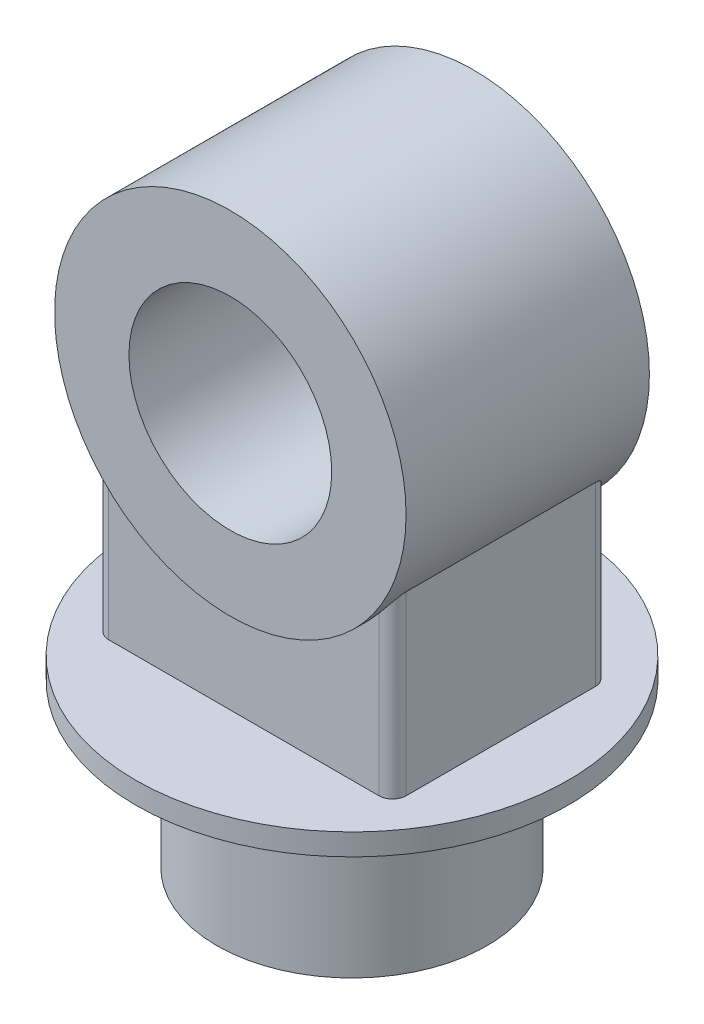
ISO-10303-21;
HEADER;
FILE_DESCRIPTION(('STEP AP214'),'2;1');
FILE_NAME('part.step','',(''),(''),'','','');
FILE_SCHEMA(('AUTOMOTIVE_DESIGN { 1 0 10303 214 1 1 1 1 }'));
ENDSEC;
DATA;
#1=APPLICATION_CONTEXT('core data for automotive mechanical design processes');
#2=APPLICATION_PROTOCOL_DEFINITION('international standard','automotive_design',2000,#1);
#3=PRODUCT_CONTEXT('',#1,'mechanical');
#4=PRODUCT('Part','Part','',(#3));
#5=PRODUCT_RELATED_PRODUCT_CATEGORY('part','',(#4));
#6=PRODUCT_DEFINITION_FORMATION('','',#4);
#7=PRODUCT_DEFINITION_CONTEXT('part definition',#1,'design');
#8=PRODUCT_DEFINITION('design','',#6,#7);
#9=PRODUCT_DEFINITION_SHAPE('','',#8);
#10=(LENGTH_UNIT() NAMED_UNIT(*) SI_UNIT(.MILLI.,.METRE.));
#11=(NAMED_UNIT(*) PLANE_ANGLE_UNIT() SI_UNIT($,.RADIAN.));
#12=(NAMED_UNIT(*) SI_UNIT($,.STERADIAN.) SOLID_ANGLE_UNIT());
#13=UNCERTAINTY_MEASURE_WITH_UNIT(LENGTH_MEASURE(1.E-05),#10,'distance_accuracy_value','');
#14=(GEOMETRIC_REPRESENTATION_CONTEXT(3) GLOBAL_UNCERTAINTY_ASSIGNED_CONTEXT((#13)) GLOBAL_UNIT_ASSIGNED_CONTEXT((#10,
#11,#12)) REPRESENTATION_CONTEXT('',''));
#15=CARTESIAN_POINT('',(0.,0.,0.));
#16=DIRECTION('',(0.,0.,1.));
#17=DIRECTION('',(1.,0.,0.));
#18=AXIS2_PLACEMENT_3D('',#15,#16,#17);
#19=CARTESIAN_POINT('',(0.,120.,0.));
#20=DIRECTION('',(0.,-1.,0.));
#21=DIRECTION('',(0.,0.,-1.));
#22=AXIS2_PLACEMENT_3D('',#19,#20,#21);
#23=CYLINDRICAL_SURFACE('',#22,100.);
#24=CARTESIAN_POINT('',(0.,120.,0.));
#25=DIRECTION('',(0.,1.,0.));
#26=DIRECTION('',(0.,0.,1.));
#27=AXIS2_PLACEMENT_3D('',#24,#25,#26);
#28=CIRCLE('',#27,100.);
#29=CARTESIAN_POINT('',(0.,120.,100.));
#30=VERTEX_POINT('',#29);
#31=EDGE_CURVE('E144',#30,#30,#28,.T.);
#32=ORIENTED_EDGE('',*,*,#31,.F.);
#33=EDGE_LOOP('',(#32));
#34=FACE_BOUND('',#33,.T.);
#35=CARTESIAN_POINT('',(0.,0.,0.));
#36=DIRECTION('',(0.,1.,0.));
#37=DIRECTION('',(0.,0.,1.));
#38=AXIS2_PLACEMENT_3D('',#35,#36,#37);
#39=CIRCLE('',#38,100.);
#40=CARTESIAN_POINT('',(0.,0.,100.));
#41=VERTEX_POINT('',#40);
#42=EDGE_CURVE('E218',#41,#41,#39,.T.);
#43=ORIENTED_EDGE('',*,*,#42,.T.);
#44=EDGE_LOOP('',(#43));
#45=FACE_BOUND('',#44,.T.);
#46=ADVANCED_FACE('F43',(#34,#45),#23,.T.);
#47=CARTESIAN_POINT('',(0.,0.,0.));
#48=DIRECTION('',(0.,1.,0.));
#49=DIRECTION('',(0.,0.,1.));
#50=AXIS2_PLACEMENT_3D('',#47,#48,#49);
#51=PLANE('',#50);
#52=ORIENTED_EDGE('',*,*,#42,.F.);
#53=EDGE_LOOP('',(#52));
#54=FACE_BOUND('',#53,.T.);
#55=ADVANCED_FACE('F206',(#54),#51,.F.);
#56=CARTESIAN_POINT('',(0.,136.,0.));
#57=DIRECTION('',(0.,-1.,0.));
#58=DIRECTION('',(0.,0.,-1.));
#59=AXIS2_PLACEMENT_3D('',#56,#57,#58);
#60=CYLINDRICAL_SURFACE('',#59,160.);
#61=CARTESIAN_POINT('',(0.,136.,0.));
#62=DIRECTION('',(0.,1.,0.));
#63=DIRECTION('',(0.,0.,1.));
#64=AXIS2_PLACEMENT_3D('',#61,#62,#63);
#65=CIRCLE('',#64,160.);
#66=CARTESIAN_POINT('',(0.,136.,160.));
#67=VERTEX_POINT('',#66);
#68=EDGE_CURVE('E219',#67,#67,#65,.T.);
#69=ORIENTED_EDGE('',*,*,#68,.F.);
#70=EDGE_LOOP('',(#69));
#71=FACE_BOUND('',#70,.T.);
#72=CARTESIAN_POINT('',(0.,120.,0.));
#73=DIRECTION('',(0.,1.,0.));
#74=DIRECTION('',(0.,0.,1.));
#75=AXIS2_PLACEMENT_3D('',#72,#73,#74);
#76=CIRCLE('',#75,160.);
#77=CARTESIAN_POINT('',(0.,120.,160.));
#78=VERTEX_POINT('',#77);
#79=EDGE_CURVE('E222',#78,#78,#76,.T.);
#80=ORIENTED_EDGE('',*,*,#79,.T.);
#81=EDGE_LOOP('',(#80));
#82=FACE_BOUND('',#81,.T.);
#83=ADVANCED_FACE('F211',(#71,#82),#60,.T.);
#84=CARTESIAN_POINT('',(0.,136.,0.));
#85=DIRECTION('',(0.,1.,0.));
#86=DIRECTION('',(0.,0.,1.));
#87=AXIS2_PLACEMENT_3D('',#84,#85,#86);
#88=PLANE('',#87);
#89=DIRECTION('',(0.,0.,-1.));
#90=VECTOR('',#89,1.);
#91=CARTESIAN_POINT('',(110.,136.,80.));
#92=LINE('',#91,#90);
#93=CARTESIAN_POINT('',(110.,136.,70.));
#94=VERTEX_POINT('',#93);
#95=CARTESIAN_POINT('',(110.,136.,-70.));
#96=VERTEX_POINT('',#95);
#97=EDGE_CURVE('E226',#94,#96,#92,.T.);
#98=ORIENTED_EDGE('',*,*,#97,.F.);
#99=CARTESIAN_POINT('',(100.,136.,70.));
#100=DIRECTION('',(0.,1.,0.));
#101=DIRECTION('',(0.,0.,1.));
#102=AXIS2_PLACEMENT_3D('',#99,#100,#101);
#103=CIRCLE('',#102,10.);
#104=CARTESIAN_POINT('',(100.,136.,80.));
#105=VERTEX_POINT('',#104);
#106=EDGE_CURVE('E126',#94,#105,#103,.F.);
#107=ORIENTED_EDGE('',*,*,#106,.T.);
#108=DIRECTION('',(1.,0.,0.));
#109=VECTOR('',#108,1.);
#110=CARTESIAN_POINT('',(-110.,136.,80.));
#111=LINE('',#110,#109);
#112=CARTESIAN_POINT('',(-100.,136.,80.));
#113=VERTEX_POINT('',#112);
#114=EDGE_CURVE('E231',#113,#105,#111,.T.);
#115=ORIENTED_EDGE('',*,*,#114,.F.);
#116=CARTESIAN_POINT('',(-100.,136.,70.));
#117=DIRECTION('',(0.,1.,0.));
#118=DIRECTION('',(0.,0.,1.));
#119=AXIS2_PLACEMENT_3D('',#116,#117,#118);
#120=CIRCLE('',#119,10.);
#121=CARTESIAN_POINT('',(-110.,136.,70.));
#122=VERTEX_POINT('',#121);
#123=EDGE_CURVE('E57',#113,#122,#120,.F.);
#124=ORIENTED_EDGE('',*,*,#123,.T.);
#125=DIRECTION('',(0.,0.,1.));
#126=VECTOR('',#125,1.);
#127=CARTESIAN_POINT('',(-110.,136.,80.));
#128=LINE('',#127,#126);
#129=CARTESIAN_POINT('',(-110.,136.,-70.));
#130=VERTEX_POINT('',#129);
#131=EDGE_CURVE('E234',#130,#122,#128,.T.);
#132=ORIENTED_EDGE('',*,*,#131,.F.);
#133=CARTESIAN_POINT('',(-100.,136.,-70.));
#134=DIRECTION('',(0.,1.,0.));
#135=DIRECTION('',(0.,0.,1.));
#136=AXIS2_PLACEMENT_3D('',#133,#134,#135);
#137=CIRCLE('',#136,10.);
#138=CARTESIAN_POINT('',(-100.,136.,-80.));
#139=VERTEX_POINT('',#138);
#140=EDGE_CURVE('E71',#130,#139,#137,.F.);
#141=ORIENTED_EDGE('',*,*,#140,.T.);
#142=DIRECTION('',(-1.,0.,0.));
#143=VECTOR('',#142,1.);
#144=CARTESIAN_POINT('',(-110.,136.,-80.));
#145=LINE('',#144,#143);
#146=CARTESIAN_POINT('',(100.,136.,-80.));
#147=VERTEX_POINT('',#146);
#148=EDGE_CURVE('E237',#147,#139,#145,.T.);
#149=ORIENTED_EDGE('',*,*,#148,.F.);
#150=CARTESIAN_POINT('',(100.,136.,-70.));
#151=DIRECTION('',(0.,1.,0.));
#152=DIRECTION('',(0.,0.,1.));
#153=AXIS2_PLACEMENT_3D('',#150,#151,#152);
#154=CIRCLE('',#153,10.);
#155=EDGE_CURVE('E127',#147,#96,#154,.F.);
#156=ORIENTED_EDGE('',*,*,#155,.T.);
#157=EDGE_LOOP('',(#98,#107,#115,#124,#132,#141,#149,#156));
#158=FACE_BOUND('',#157,.T.);
#159=ORIENTED_EDGE('',*,*,#68,.T.);
#160=EDGE_LOOP('',(#159));
#161=FACE_BOUND('',#160,.T.);
#162=ADVANCED_FACE('F368',(#158,#161),#88,.T.);
#163=CARTESIAN_POINT('',(0.,120.,0.));
#164=DIRECTION('',(0.,1.,0.));
#165=DIRECTION('',(0.,0.,1.));
#166=AXIS2_PLACEMENT_3D('',#163,#164,#165);
#167=PLANE('',#166);
#168=ORIENTED_EDGE('',*,*,#31,.T.);
#169=EDGE_LOOP('',(#168));
#170=FACE_BOUND('',#169,.T.);
#171=ORIENTED_EDGE('',*,*,#79,.F.);
#172=EDGE_LOOP('',(#171));
#173=FACE_BOUND('',#172,.T.);
#174=ADVANCED_FACE('F337',(#170,#173),#167,.F.);
#175=CARTESIAN_POINT('',(-110.,466.002,-80.));
#176=DIRECTION('',(0.,0.,1.));
#177=DIRECTION('',(1.,0.,0.));
#178=AXIS2_PLACEMENT_3D('',#175,#176,#177);
#179=PLANE('',#178);
#180=CARTESIAN_POINT('',(0.,336.,-80.));
#181=DIRECTION('',(0.,0.,1.));
#182=DIRECTION('',(1.,0.,0.));
#183=AXIS2_PLACEMENT_3D('',#180,#181,#182);
#184=CIRCLE('',#183,130.);
#185=CARTESIAN_POINT('',(100.,252.933761370819,-80.));
#186=VERTEX_POINT('',#185);
#187=CARTESIAN_POINT('',(-100.,252.933761370819,-80.));
#188=VERTEX_POINT('',#187);
#189=EDGE_CURVE('E119',#186,#188,#184,.F.);
#190=ORIENTED_EDGE('',*,*,#189,.F.);
#191=DIRECTION('',(0.,-1.,0.));
#192=VECTOR('',#191,1.);
#193=CARTESIAN_POINT('',(100.,466.002,-80.));
#194=LINE('',#193,#192);
#195=EDGE_CURVE('E133',#186,#147,#194,.T.);
#196=ORIENTED_EDGE('',*,*,#195,.T.);
#197=ORIENTED_EDGE('',*,*,#148,.T.);
#198=DIRECTION('',(0.,-1.,0.));
#199=VECTOR('',#198,1.);
#200=CARTESIAN_POINT('',(-100.,466.002,-80.));
#201=LINE('',#200,#199);
#202=EDGE_CURVE('E135',#139,#188,#201,.F.);
#203=ORIENTED_EDGE('',*,*,#202,.T.);
#204=EDGE_LOOP('',(#190,#196,#197,#203));
#205=FACE_BOUND('',#204,.T.);
#206=ADVANCED_FACE('F131',(#205),#179,.F.);
#207=CARTESIAN_POINT('',(110.,466.002,80.));
#208=DIRECTION('',(-1.,0.,0.));
#209=DIRECTION('',(0.,0.,1.));
#210=AXIS2_PLACEMENT_3D('',#207,#208,#209);
#211=PLANE('',#210);
#212=ORIENTED_EDGE('',*,*,#97,.T.);
#213=DIRECTION('',(0.,-1.,0.));
#214=VECTOR('',#213,1.);
#215=CARTESIAN_POINT('',(110.,466.002,-70.));
#216=LINE('',#215,#214);
#217=CARTESIAN_POINT('',(110.,266.717967697245,-70.));
#218=VERTEX_POINT('',#217);
#219=EDGE_CURVE('E142',#96,#218,#216,.F.);
#220=ORIENTED_EDGE('',*,*,#219,.T.);
#221=DIRECTION('',(0.,0.,-1.));
#222=VECTOR('',#221,1.);
#223=CARTESIAN_POINT('',(110.,266.717967697245,90.));
#224=LINE('',#223,#222);
#225=CARTESIAN_POINT('',(110.,266.717967697245,70.));
#226=VERTEX_POINT('',#225);
#227=EDGE_CURVE('E122',#226,#218,#224,.T.);
#228=ORIENTED_EDGE('',*,*,#227,.F.);
#229=DIRECTION('',(0.,-1.,0.));
#230=VECTOR('',#229,1.);
#231=CARTESIAN_POINT('',(110.,466.002,70.));
#232=LINE('',#231,#230);
#233=EDGE_CURVE('E139',#226,#94,#232,.T.);
#234=ORIENTED_EDGE('',*,*,#233,.T.);
#235=EDGE_LOOP('',(#212,#220,#228,#234));
#236=FACE_BOUND('',#235,.T.);
#237=ADVANCED_FACE('F320',(#236),#211,.F.);
#238=CARTESIAN_POINT('',(-110.,466.002,80.));
#239=DIRECTION('',(1.,0.,0.));
#240=DIRECTION('',(0.,0.,-1.));
#241=AXIS2_PLACEMENT_3D('',#238,#239,#240);
#242=PLANE('',#241);
#243=DIRECTION('',(0.,0.,-1.));
#244=VECTOR('',#243,1.);
#245=CARTESIAN_POINT('',(-110.,266.717967697245,90.));
#246=LINE('',#245,#244);
#247=CARTESIAN_POINT('',(-110.,266.717967697245,-70.));
#248=VERTEX_POINT('',#247);
#249=CARTESIAN_POINT('',(-110.,266.717967697245,70.));
#250=VERTEX_POINT('',#249);
#251=EDGE_CURVE('E136',#248,#250,#246,.F.);
#252=ORIENTED_EDGE('',*,*,#251,.F.);
#253=DIRECTION('',(0.,-1.,0.));
#254=VECTOR('',#253,1.);
#255=CARTESIAN_POINT('',(-110.,466.002,-70.));
#256=LINE('',#255,#254);
#257=EDGE_CURVE('E156',#248,#130,#256,.T.);
#258=ORIENTED_EDGE('',*,*,#257,.T.);
#259=ORIENTED_EDGE('',*,*,#131,.T.);
#260=DIRECTION('',(0.,-1.,0.));
#261=VECTOR('',#260,1.);
#262=CARTESIAN_POINT('',(-110.,466.002,70.));
#263=LINE('',#262,#261);
#264=EDGE_CURVE('E154',#122,#250,#263,.F.);
#265=ORIENTED_EDGE('',*,*,#264,.T.);
#266=EDGE_LOOP('',(#252,#258,#259,#265));
#267=FACE_BOUND('',#266,.T.);
#268=ADVANCED_FACE('F196',(#267),#242,.F.);
#269=CARTESIAN_POINT('',(-110.,466.002,80.));
#270=DIRECTION('',(0.,0.,-1.));
#271=DIRECTION('',(-1.,0.,0.));
#272=AXIS2_PLACEMENT_3D('',#269,#270,#271);
#273=PLANE('',#272);
#274=ORIENTED_EDGE('',*,*,#114,.T.);
#275=DIRECTION('',(0.,-1.,0.));
#276=VECTOR('',#275,1.);
#277=CARTESIAN_POINT('',(100.,466.002,80.));
#278=LINE('',#277,#276);
#279=CARTESIAN_POINT('',(100.,252.933761370819,80.));
#280=VERTEX_POINT('',#279);
#281=EDGE_CURVE('E152',#105,#280,#278,.F.);
#282=ORIENTED_EDGE('',*,*,#281,.T.);
#283=CARTESIAN_POINT('',(0.,336.,80.));
#284=DIRECTION('',(0.,0.,-1.));
#285=DIRECTION('',(-1.,0.,0.));
#286=AXIS2_PLACEMENT_3D('',#283,#284,#285);
#287=CIRCLE('',#286,130.);
#288=CARTESIAN_POINT('',(-100.,252.933761370819,80.));
#289=VERTEX_POINT('',#288);
#290=EDGE_CURVE('E198',#289,#280,#287,.F.);
#291=ORIENTED_EDGE('',*,*,#290,.F.);
#292=DIRECTION('',(0.,-1.,0.));
#293=VECTOR('',#292,1.);
#294=CARTESIAN_POINT('',(-100.,466.002,80.));
#295=LINE('',#294,#293);
#296=EDGE_CURVE('E149',#289,#113,#295,.T.);
#297=ORIENTED_EDGE('',*,*,#296,.T.);
#298=EDGE_LOOP('',(#274,#282,#291,#297));
#299=FACE_BOUND('',#298,.T.);
#300=ADVANCED_FACE('F264',(#299),#273,.F.);
#301=CARTESIAN_POINT('',(0.,336.,90.));
#302=DIRECTION('',(0.,0.,-1.));
#303=DIRECTION('',(-1.,0.,0.));
#304=AXIS2_PLACEMENT_3D('',#301,#302,#303);
#305=CYLINDRICAL_SURFACE('',#304,130.);
#306=CARTESIAN_POINT('',(0.,336.,90.));
#307=DIRECTION('',(0.,0.,1.));
#308=DIRECTION('',(1.,0.,0.));
#309=AXIS2_PLACEMENT_3D('',#306,#307,#308);
#310=CIRCLE('',#309,130.);
#311=CARTESIAN_POINT('',(130.,336.,90.));
#312=VERTEX_POINT('',#311);
#313=EDGE_CURVE('E228',#312,#312,#310,.T.);
#314=ORIENTED_EDGE('',*,*,#313,.F.);
#315=EDGE_LOOP('',(#314));
#316=FACE_BOUND('',#315,.T.);
#317=CARTESIAN_POINT('',(0.,336.,-90.));
#318=DIRECTION('',(0.,0.,1.));
#319=DIRECTION('',(1.,0.,0.));
#320=AXIS2_PLACEMENT_3D('',#317,#318,#319);
#321=CIRCLE('',#320,130.);
#322=CARTESIAN_POINT('',(130.,336.,-90.));
#323=VERTEX_POINT('',#322);
#324=EDGE_CURVE('E240',#323,#323,#321,.T.);
#325=ORIENTED_EDGE('',*,*,#324,.T.);
#326=EDGE_LOOP('',(#325));
#327=FACE_BOUND('',#326,.T.);
#328=ORIENTED_EDGE('',*,*,#290,.T.);
#329=CARTESIAN_POINT('',(100.,252.933761370819,80.));
#330=CARTESIAN_POINT('',(100.223611151915,253.202952503255,79.9999830665315));
#331=CARTESIAN_POINT('',(100.446118360057,253.473036166024,79.9924995885085));
#332=CARTESIAN_POINT('',(100.888548742496,254.014496760122,79.9629173131463));
#333=CARTESIAN_POINT('',(101.108472043759,254.285873626978,79.9408192370116));
#334=CARTESIAN_POINT('',(101.545586290072,254.829711400373,79.8822979337703));
#335=CARTESIAN_POINT('',(101.76277446753,255.102173087004,79.8458612385231));
#336=CARTESIAN_POINT('',(102.193849033468,255.647413797012,79.7588609087488));
#337=CARTESIAN_POINT('',(102.407735374993,255.920192824843,79.7082970735217));
#338=CARTESIAN_POINT('',(103.048408055095,256.74400885936,79.5343891784366));
#339=CARTESIAN_POINT('',(103.469748368072,257.294974230618,79.3894263280958));
#340=CARTESIAN_POINT('',(104.088382224678,258.117224843771,79.1288060997197));
#341=CARTESIAN_POINT('',(104.292337034927,258.39057162742,79.0347525474724));
#342=CARTESIAN_POINT('',(104.695498702643,258.935304765081,78.8319429710981));
#343=CARTESIAN_POINT('',(104.894706004332,259.206691300842,78.7231883289499));
#344=CARTESIAN_POINT('',(105.336170271764,259.812965668139,78.4620472638272));
#345=CARTESIAN_POINT('',(105.577006541077,260.147108038148,78.3055009036513));
#346=CARTESIAN_POINT('',(106.04966094987,260.809343252621,77.967808626391));
#347=CARTESIAN_POINT('',(106.281479043935,261.137436066616,77.7866625854443));
#348=CARTESIAN_POINT('',(106.734152264033,261.784259610706,77.3986376161628));
#349=CARTESIAN_POINT('',(106.955036134368,262.103013877599,77.1918317878757));
#350=CARTESIAN_POINT('',(107.384708325122,262.728803605627,76.749894392022));
#351=CARTESIAN_POINT('',(107.593501627276,263.035843875289,76.5147746155492));
#352=CARTESIAN_POINT('',(107.921279015409,263.522080966666,76.1068757916445));
#353=CARTESIAN_POINT('',(108.044709884718,263.706240813682,75.9435605188262));
#354=CARTESIAN_POINT('',(108.284949666933,264.066582834907,75.6038296157538));
#355=CARTESIAN_POINT('',(108.401760304956,264.242767084986,75.4274174262628));
#356=CARTESIAN_POINT('',(108.627683741988,264.585236991633,75.0605773993746));
#357=CARTESIAN_POINT('',(108.736797961361,264.751524473746,74.8701521613913));
#358=CARTESIAN_POINT('',(108.945874410432,265.071634412635,74.4745306992528));
#359=CARTESIAN_POINT('',(109.04583974995,265.225461102935,74.2693395369045));
#360=CARTESIAN_POINT('',(109.274660386151,265.579056080623,73.7536743100227));
#361=CARTESIAN_POINT('',(109.398046362816,265.771031349643,73.4351396850743));
#362=CARTESIAN_POINT('',(109.561336457207,266.026263049992,72.9345418523036));
#363=CARTESIAN_POINT('',(109.612072269395,266.105785634321,72.7641622498837));
#364=CARTESIAN_POINT('',(109.705421847597,266.25239837099,72.4160328323222));
#365=CARTESIAN_POINT('',(109.748040656091,266.319496241142,72.2382876769633));
#366=CARTESIAN_POINT('',(109.820262744001,266.433384610412,71.8947331689276));
#367=CARTESIAN_POINT('',(109.850752312767,266.481551609067,71.729567610939));
#368=CARTESIAN_POINT('',(109.903691363628,266.565274678987,71.3948451418076));
#369=CARTESIAN_POINT('',(109.926143541964,266.600834979285,71.2252897238033));
#370=CARTESIAN_POINT('',(109.962659042777,266.658707696818,70.8807814271977));
#371=CARTESIAN_POINT('',(109.976613864032,266.680848750137,70.7057875562757));
#372=CARTESIAN_POINT('',(109.99061964662,266.703076138542,70.4419386674803));
#373=CARTESIAN_POINT('',(109.99413386492,266.708654625171,70.3536902139711));
#374=CARTESIAN_POINT('',(109.998824989492,266.716102079046,70.1769662160102));
#375=CARTESIAN_POINT('',(110.000001659485,266.717970671296,70.088490649507));
#376=CARTESIAN_POINT('',(110.,266.717967697245,70.));
#377=B_SPLINE_CURVE_WITH_KNOTS('',3,(#329,#330,#331,#332,#333,#334,#335,#336,#337,#338,#339,
#340,#341,#342,#343,#344,#345,#346,#347,#348,#349,#350,#351,#352,#353,#354,#355,#356,#357,#358,
#359,#360,#361,#362,#363,#364,#365,#366,#367,#368,#369,#370,#371,#372,#373,#374,#375,#376),
.UNSPECIFIED.,.F.,.F.,(4,2,2,2,2,2,2,2,2,2,2,2,2,2,2,2,2,2,2,2,2,2,2,4),(0.,1.04974156507783,
2.09943133114567,3.15010942417265,4.20080244462032,6.32356278933861,7.38465211465335,
8.44564176134501,9.76677685539399,11.087918601761,12.4053795382949,13.7222937149077,
14.5479419827464,15.3733741023698,16.1986534888325,17.0236513022889,18.1946866504919,
18.7783719827905,19.3616935243415,19.8852298594993,20.408590403038,20.9385006934629,
21.2038887699912,21.4693036704869),.UNSPECIFIED.);
#378=EDGE_CURVE('E180',#280,#226,#377,.T.);
#379=ORIENTED_EDGE('',*,*,#378,.T.);
#380=ORIENTED_EDGE('',*,*,#227,.T.);
#381=CARTESIAN_POINT('',(110.,266.717967697245,-70.));
#382=CARTESIAN_POINT('',(110.000033683462,266.718025852698,-70.1614230595313));
#383=CARTESIAN_POINT('',(109.996092792414,266.711764254296,-70.3228118197691));
#384=CARTESIAN_POINT('',(109.980519982779,266.687045880384,-70.6441123999957));
#385=CARTESIAN_POINT('',(109.968896213713,266.668602027069,-70.8040256031146));
#386=CARTESIAN_POINT('',(109.938376398954,266.620217986395,-71.1196424551221));
#387=CARTESIAN_POINT('',(109.919558261622,266.590400967593,-71.2753727040436));
#388=CARTESIAN_POINT('',(109.875071558334,266.52000006118,-71.5834085562726));
#389=CARTESIAN_POINT('',(109.849400846184,266.479412800404,-71.7357130704249));
#390=CARTESIAN_POINT('',(109.784772267017,266.377386983169,-72.0722520040974));
#391=CARTESIAN_POINT('',(109.744103525393,266.313281105856,-72.2553511890568));
#392=CARTESIAN_POINT('',(109.654040532803,266.17165023193,-72.6141464391851));
#393=CARTESIAN_POINT('',(109.604640075501,266.094115691273,-72.7898371277865));
#394=CARTESIAN_POINT('',(109.497968805892,265.927147418338,-73.133872391345));
#395=CARTESIAN_POINT('',(109.440667457039,265.837667562915,-73.302184951541));
#396=CARTESIAN_POINT('',(109.319341126161,265.648779195145,-73.6304969218558));
#397=CARTESIAN_POINT('',(109.25531768694,265.549372961282,-73.7904982269664));
#398=CARTESIAN_POINT('',(109.085069343255,265.28590129292,-74.1868876463209));
#399=CARTESIAN_POINT('',(108.974781990569,265.115997241409,-74.4176642111939));
#400=CARTESIAN_POINT('',(108.742772943656,264.76058359918,-74.8607110351426));
#401=CARTESIAN_POINT('',(108.621044869784,264.575065307649,-75.072970840064));
#402=CARTESIAN_POINT('',(108.36794946479,264.19164129378,-75.4804206329535));
#403=CARTESIAN_POINT('',(108.236568322626,263.993717884812,-75.6755852518652));
#404=CARTESIAN_POINT('',(107.965814499919,263.588382733387,-76.0497203250662));
#405=CARTESIAN_POINT('',(107.826442440892,263.380971729107,-76.2286920360201));
#406=CARTESIAN_POINT('',(107.56145650763,262.989174407744,-76.5468161797372));
#407=CARTESIAN_POINT('',(107.436764821801,262.805791987749,-76.6879854690674));
#408=CARTESIAN_POINT('',(107.182869679799,262.434497987953,-76.9599552926783));
#409=CARTESIAN_POINT('',(107.053665586411,262.24658576965,-77.0907543539386));
#410=CARTESIAN_POINT('',(106.659844344167,261.677121003612,-77.4685356621902));
#411=CARTESIAN_POINT('',(106.389102445143,261.289965080353,-77.7008024816961));
#412=CARTESIAN_POINT('',(105.833418194947,260.504836154638,-78.129863631631));
#413=CARTESIAN_POINT('',(105.548442441802,260.106838810795,-78.3265689888296));
#414=CARTESIAN_POINT('',(104.96676628824,259.304344779382,-78.6860846955171));
#415=CARTESIAN_POINT('',(104.670068038633,258.899849292081,-78.8489012287858));
#416=CARTESIAN_POINT('',(104.024574509401,258.030646711215,-79.1623550419402));
#417=CARTESIAN_POINT('',(103.674248758637,257.565348460988,-79.3081944572228));
#418=CARTESIAN_POINT('',(102.961876677953,256.632523338709,-79.558756520093));
#419=CARTESIAN_POINT('',(102.599828734006,256.16499616738,-79.6634734792563));
#420=CARTESIAN_POINT('',(102.051092736822,255.466397204689,-79.7891645729388));
#421=CARTESIAN_POINT('',(101.868137468165,255.235094848973,-79.8257282191264));
#422=CARTESIAN_POINT('',(101.499966150616,254.77288550036,-79.8886289353229));
#423=CARTESIAN_POINT('',(101.314750133026,254.541978502041,-79.9149661467555));
#424=CARTESIAN_POINT('',(100.942320486513,254.080919722901,-79.9572665465168));
#425=CARTESIAN_POINT('',(100.755107350153,253.850767773367,-79.9732322353467));
#426=CARTESIAN_POINT('',(100.378860262163,253.391449185777,-79.9945948234744));
#427=CARTESIAN_POINT('',(100.189826234412,253.162282589497,-79.9999912789888));
#428=CARTESIAN_POINT('',(100.,252.933761370819,-80.));
#429=B_SPLINE_CURVE_WITH_KNOTS('',3,(#381,#382,#383,#384,#385,#386,#387,#388,#389,#390,#391,
#392,#393,#394,#395,#396,#397,#398,#399,#400,#401,#402,#403,#404,#405,#406,#407,#408,#409,#410,
#411,#412,#413,#414,#415,#416,#417,#418,#419,#420,#421,#422,#423,#424,#425,#426,#427,#428),
.UNSPECIFIED.,.F.,.F.,(4,2,2,2,2,2,2,2,2,2,2,2,2,2,2,2,2,2,2,2,2,2,2,4),(0.,0.484045005923069,
0.967577389145413,1.44601544684509,1.92460352520314,2.51835043890467,3.11252108624072,
3.7090561398874,4.30545457926273,5.22516595363376,6.14539326092329,7.06696382284195,
7.98846280401965,8.77680092000541,9.56525081419904,11.1426900482287,12.7240229357798,
14.305067020047,16.1047501551828,17.9046821508917,18.7960435003637,19.6873925225409,
20.5785265668948,21.4696980275819),.UNSPECIFIED.);
#430=EDGE_CURVE('E115',#218,#186,#429,.T.);
#431=ORIENTED_EDGE('',*,*,#430,.T.);
#432=ORIENTED_EDGE('',*,*,#189,.T.);
#433=CARTESIAN_POINT('',(-100.,252.933761370819,-80.));
#434=CARTESIAN_POINT('',(-100.223611151915,253.202952503255,-79.9999830665315));
#435=CARTESIAN_POINT('',(-100.446118360057,253.473036166024,-79.9924995885085));
#436=CARTESIAN_POINT('',(-100.888548742496,254.014496760122,-79.9629173131463));
#437=CARTESIAN_POINT('',(-101.108472043759,254.285873626978,-79.9408192370116));
#438=CARTESIAN_POINT('',(-101.545586290072,254.829711400373,-79.8822979337703));
#439=CARTESIAN_POINT('',(-101.76277446753,255.102173087004,-79.8458612385231));
#440=CARTESIAN_POINT('',(-102.193849033468,255.647413797012,-79.7588609087488));
#441=CARTESIAN_POINT('',(-102.407735374993,255.920192824843,-79.7082970735217));
#442=CARTESIAN_POINT('',(-103.048408055095,256.74400885936,-79.5343891784366));
#443=CARTESIAN_POINT('',(-103.469748368072,257.294974230618,-79.3894263280958));
#444=CARTESIAN_POINT('',(-104.088382224678,258.117224843771,-79.1288060997198));
#445=CARTESIAN_POINT('',(-104.292337034927,258.39057162742,-79.0347525474725));
#446=CARTESIAN_POINT('',(-104.695498702643,258.935304765081,-78.8319429710982));
#447=CARTESIAN_POINT('',(-104.894706004332,259.206691300842,-78.7231883289499));
#448=CARTESIAN_POINT('',(-105.336170271764,259.812965668139,-78.4620472638272));
#449=CARTESIAN_POINT('',(-105.577006541077,260.147108038148,-78.3055009036513));
#450=CARTESIAN_POINT('',(-106.04966094987,260.809343252621,-77.967808626391));
#451=CARTESIAN_POINT('',(-106.281479043935,261.137436066616,-77.7866625854444));
#452=CARTESIAN_POINT('',(-106.734152264033,261.784259610706,-77.3986376161629));
#453=CARTESIAN_POINT('',(-106.955036134368,262.103013877598,-77.1918317878757));
#454=CARTESIAN_POINT('',(-107.384708325122,262.728803605627,-76.749894392022));
#455=CARTESIAN_POINT('',(-107.593501627276,263.035843875289,-76.5147746155493));
#456=CARTESIAN_POINT('',(-107.921279015409,263.522080966667,-76.1068757916446));
#457=CARTESIAN_POINT('',(-108.044709884718,263.706240813682,-75.9435605188263));
#458=CARTESIAN_POINT('',(-108.284949666933,264.066582834907,-75.6038296157538));
#459=CARTESIAN_POINT('',(-108.401760304956,264.242767084986,-75.4274174262628));
#460=CARTESIAN_POINT('',(-108.627683741988,264.585236991633,-75.0605773993746));
#461=CARTESIAN_POINT('',(-108.736797961361,264.751524473746,-74.8701521613912));
#462=CARTESIAN_POINT('',(-108.945874410432,265.071634412635,-74.4745306992528));
#463=CARTESIAN_POINT('',(-109.04583974995,265.225461102935,-74.2693395369045));
#464=CARTESIAN_POINT('',(-109.274660386151,265.579056080623,-73.7536743100227));
#465=CARTESIAN_POINT('',(-109.398046362816,265.771031349643,-73.4351396850742));
#466=CARTESIAN_POINT('',(-109.561336457207,266.026263049992,-72.9345418523035));
#467=CARTESIAN_POINT('',(-109.612072269395,266.105785634321,-72.7641622498836));
#468=CARTESIAN_POINT('',(-109.705421847597,266.25239837099,-72.4160328323222));
#469=CARTESIAN_POINT('',(-109.748040656091,266.319496241142,-72.2382876769633));
#470=CARTESIAN_POINT('',(-109.820262744001,266.433384610412,-71.8947331689276));
#471=CARTESIAN_POINT('',(-109.850752312767,266.481551609067,-71.729567610939));
#472=CARTESIAN_POINT('',(-109.903691363628,266.565274678988,-71.3948451418076));
#473=CARTESIAN_POINT('',(-109.926143541964,266.600834979285,-71.2252897238033));
#474=CARTESIAN_POINT('',(-109.962659042777,266.658707696818,-70.8807814271977));
#475=CARTESIAN_POINT('',(-109.976613864032,266.680848750137,-70.7057875562757));
#476=CARTESIAN_POINT('',(-109.99061964662,266.703076138542,-70.4419386674803));
#477=CARTESIAN_POINT('',(-109.99413386492,266.708654625171,-70.3536902139711));
#478=CARTESIAN_POINT('',(-109.998824989492,266.716102079046,-70.1769662160102));
#479=CARTESIAN_POINT('',(-110.000001659485,266.717970671296,-70.088490649507));
#480=CARTESIAN_POINT('',(-110.,266.717967697245,-70.));
#481=B_SPLINE_CURVE_WITH_KNOTS('',3,(#433,#434,#435,#436,#437,#438,#439,#440,#441,#442,#443,
#444,#445,#446,#447,#448,#449,#450,#451,#452,#453,#454,#455,#456,#457,#458,#459,#460,#461,#462,
#463,#464,#465,#466,#467,#468,#469,#470,#471,#472,#473,#474,#475,#476,#477,#478,#479,#480),
.UNSPECIFIED.,.F.,.F.,(4,2,2,2,2,2,2,2,2,2,2,2,2,2,2,2,2,2,2,2,2,2,2,4),(0.,1.04974156507777,
2.09943133114568,3.1501094241726,4.20080244462026,6.32356278933854,7.38465211465329,
8.44564176134495,9.7667768553939,11.0879186017609,12.4053795382948,13.7222937149076,
14.5479419827464,15.3733741023698,16.1986534888326,17.023651302289,18.194686650492,
18.7783719827905,19.3616935243415,19.8852298594992,20.4085904030381,20.9385006934629,
21.2038887699912,21.4693036704869),.UNSPECIFIED.);
#482=EDGE_CURVE('E187',#188,#248,#481,.T.);
#483=ORIENTED_EDGE('',*,*,#482,.T.);
#484=ORIENTED_EDGE('',*,*,#251,.T.);
#485=CARTESIAN_POINT('',(-110.,266.717967697245,70.));
#486=CARTESIAN_POINT('',(-110.000033683462,266.718025852698,70.1614230595313));
#487=CARTESIAN_POINT('',(-109.996092792414,266.711764254296,70.3228118197691));
#488=CARTESIAN_POINT('',(-109.980519982779,266.687045880384,70.6441123999957));
#489=CARTESIAN_POINT('',(-109.968896213713,266.668602027069,70.8040256031146));
#490=CARTESIAN_POINT('',(-109.938376398954,266.620217986395,71.1196424551221));
#491=CARTESIAN_POINT('',(-109.919558261622,266.590400967593,71.2753727040436));
#492=CARTESIAN_POINT('',(-109.875071558334,266.52000006118,71.5834085562726));
#493=CARTESIAN_POINT('',(-109.849400846184,266.479412800404,71.7357130704249));
#494=CARTESIAN_POINT('',(-109.784772267017,266.377386983169,72.0722520040974));
#495=CARTESIAN_POINT('',(-109.744103525393,266.313281105856,72.2553511890568));
#496=CARTESIAN_POINT('',(-109.654040532803,266.17165023193,72.6141464391851));
#497=CARTESIAN_POINT('',(-109.604640075501,266.094115691273,72.7898371277865));
#498=CARTESIAN_POINT('',(-109.497968805892,265.927147418338,73.133872391345));
#499=CARTESIAN_POINT('',(-109.440667457039,265.837667562915,73.302184951541));
#500=CARTESIAN_POINT('',(-109.319341126161,265.648779195145,73.6304969218558));
#501=CARTESIAN_POINT('',(-109.25531768694,265.549372961282,73.7904982269664));
#502=CARTESIAN_POINT('',(-109.085069343255,265.28590129292,74.1868876463209));
#503=CARTESIAN_POINT('',(-108.974781990569,265.115997241409,74.4176642111939));
#504=CARTESIAN_POINT('',(-108.742772943656,264.76058359918,74.8607110351426));
#505=CARTESIAN_POINT('',(-108.621044869784,264.575065307649,75.072970840064));
#506=CARTESIAN_POINT('',(-108.36794946479,264.19164129378,75.4804206329535));
#507=CARTESIAN_POINT('',(-108.236568322626,263.993717884812,75.6755852518652));
#508=CARTESIAN_POINT('',(-107.965814499919,263.588382733388,76.0497203250662));
#509=CARTESIAN_POINT('',(-107.826442440892,263.380971729107,76.2286920360201));
#510=CARTESIAN_POINT('',(-107.56145650763,262.989174407744,76.5468161797372));
#511=CARTESIAN_POINT('',(-107.436764821801,262.805791987749,76.6879854690674));
#512=CARTESIAN_POINT('',(-107.182869679799,262.434497987953,76.9599552926783));
#513=CARTESIAN_POINT('',(-107.053665586411,262.24658576965,77.0907543539386));
#514=CARTESIAN_POINT('',(-106.659844344167,261.677121003612,77.4685356621902));
#515=CARTESIAN_POINT('',(-106.389102445143,261.289965080353,77.7008024816961));
#516=CARTESIAN_POINT('',(-105.833418194947,260.504836154638,78.129863631631));
#517=CARTESIAN_POINT('',(-105.548442441802,260.106838810795,78.3265689888296));
#518=CARTESIAN_POINT('',(-104.96676628824,259.304344779382,78.6860846955171));
#519=CARTESIAN_POINT('',(-104.670068038633,258.899849292081,78.8489012287858));
#520=CARTESIAN_POINT('',(-104.024574509401,258.030646711215,79.1623550419402));
#521=CARTESIAN_POINT('',(-103.674248758637,257.565348460988,79.3081944572228));
#522=CARTESIAN_POINT('',(-102.961876677953,256.632523338709,79.558756520093));
#523=CARTESIAN_POINT('',(-102.599828734006,256.16499616738,79.6634734792563));
#524=CARTESIAN_POINT('',(-102.051092736822,255.466397204689,79.7891645729388));
#525=CARTESIAN_POINT('',(-101.868137468165,255.235094848973,79.8257282191264));
#526=CARTESIAN_POINT('',(-101.499966150616,254.77288550036,79.8886289353229));
#527=CARTESIAN_POINT('',(-101.314750133026,254.541978502041,79.9149661467555));
#528=CARTESIAN_POINT('',(-100.942320486513,254.080919722901,79.9572665465168));
#529=CARTESIAN_POINT('',(-100.755107350153,253.850767773367,79.9732322353467));
#530=CARTESIAN_POINT('',(-100.378860262163,253.391449185777,79.9945948234744));
#531=CARTESIAN_POINT('',(-100.189826234412,253.162282589497,79.9999912789888));
#532=CARTESIAN_POINT('',(-100.,252.933761370819,80.));
#533=B_SPLINE_CURVE_WITH_KNOTS('',3,(#485,#486,#487,#488,#489,#490,#491,#492,#493,#494,#495,
#496,#497,#498,#499,#500,#501,#502,#503,#504,#505,#506,#507,#508,#509,#510,#511,#512,#513,#514,
#515,#516,#517,#518,#519,#520,#521,#522,#523,#524,#525,#526,#527,#528,#529,#530,#531,#532),
.UNSPECIFIED.,.F.,.F.,(4,2,2,2,2,2,2,2,2,2,2,2,2,2,2,2,2,2,2,2,2,2,2,4),(0.,0.484045005923072,
0.967577389145423,1.44601544684507,1.92460352520313,2.51835043890467,3.11252108624077,
3.7090561398874,4.30545457926274,5.22516595363375,6.14539326092329,7.06696382284192,
7.98846280401962,8.77680092000541,9.56525081419893,11.1426900482287,12.7240229357797,
14.305067020047,16.1047501551829,17.9046821508918,18.7960435003637,19.6873925225409,
20.5785265668947,21.4696980275819),.UNSPECIFIED.);
#534=EDGE_CURVE('E11',#250,#289,#533,.T.);
#535=ORIENTED_EDGE('',*,*,#534,.T.);
#536=EDGE_LOOP('',(#328,#379,#380,#431,#432,#483,#484,#535));
#537=FACE_BOUND('',#536,.T.);
#538=ADVANCED_FACE('F118',(#316,#327,#537),#305,.T.);
#539=CARTESIAN_POINT('',(0.,336.,90.));
#540=DIRECTION('',(0.,0.,1.));
#541=DIRECTION('',(1.,0.,0.));
#542=AXIS2_PLACEMENT_3D('',#539,#540,#541);
#543=PLANE('',#542);
#544=ORIENTED_EDGE('',*,*,#313,.T.);
#545=EDGE_LOOP('',(#544));
#546=FACE_BOUND('',#545,.T.);
#547=CARTESIAN_POINT('',(0.,336.,90.));
#548=DIRECTION('',(0.,0.,1.));
#549=DIRECTION('',(1.,0.,0.));
#550=AXIS2_PLACEMENT_3D('',#547,#548,#549);
#551=CIRCLE('',#550,75.);
#552=CARTESIAN_POINT('',(-75.,336.,90.));
#553=VERTEX_POINT('',#552);
#554=EDGE_CURVE('E243',#553,#553,#551,.T.);
#555=ORIENTED_EDGE('',*,*,#554,.F.);
#556=EDGE_LOOP('',(#555));
#557=FACE_BOUND('',#556,.T.);
#558=ADVANCED_FACE('F254',(#546,#557),#543,.T.);
#559=CARTESIAN_POINT('',(0.,336.,-90.));
#560=DIRECTION('',(0.,0.,1.));
#561=DIRECTION('',(1.,0.,0.));
#562=AXIS2_PLACEMENT_3D('',#559,#560,#561);
#563=PLANE('',#562);
#564=ORIENTED_EDGE('',*,*,#324,.F.);
#565=EDGE_LOOP('',(#564));
#566=FACE_BOUND('',#565,.T.);
#567=CARTESIAN_POINT('',(0.,336.,-90.));
#568=DIRECTION('',(0.,0.,1.));
#569=DIRECTION('',(1.,0.,0.));
#570=AXIS2_PLACEMENT_3D('',#567,#568,#569);
#571=CIRCLE('',#570,75.);
#572=CARTESIAN_POINT('',(-75.,336.,-90.));
#573=VERTEX_POINT('',#572);
#574=EDGE_CURVE('E246',#573,#573,#571,.T.);
#575=ORIENTED_EDGE('',*,*,#574,.T.);
#576=EDGE_LOOP('',(#575));
#577=FACE_BOUND('',#576,.T.);
#578=ADVANCED_FACE('F256',(#566,#577),#563,.F.);
#579=CARTESIAN_POINT('',(0.,336.,90.));
#580=DIRECTION('',(0.,0.,-1.));
#581=DIRECTION('',(-1.,0.,0.));
#582=AXIS2_PLACEMENT_3D('',#579,#580,#581);
#583=CYLINDRICAL_SURFACE('',#582,75.);
#584=CARTESIAN_POINT('',(-75.,336.,90.));
#585=CARTESIAN_POINT('',(-75.,336.,88.125));
#586=CARTESIAN_POINT('',(-75.,336.,86.25));
#587=CARTESIAN_POINT('',(-75.,336.,82.5));
#588=CARTESIAN_POINT('',(-75.,336.,80.625));
#589=CARTESIAN_POINT('',(-75.,336.,76.875));
#590=CARTESIAN_POINT('',(-75.,336.,75.));
#591=CARTESIAN_POINT('',(-75.,336.,71.25));
#592=CARTESIAN_POINT('',(-75.,336.,69.375));
#593=CARTESIAN_POINT('',(-75.,336.,65.625));
#594=CARTESIAN_POINT('',(-75.,336.,63.75));
#595=CARTESIAN_POINT('',(-75.,336.,60.));
#596=CARTESIAN_POINT('',(-75.,336.,58.125));
#597=CARTESIAN_POINT('',(-75.,336.,54.375));
#598=CARTESIAN_POINT('',(-75.,336.,52.5));
#599=CARTESIAN_POINT('',(-75.,336.,48.75));
#600=CARTESIAN_POINT('',(-75.,336.,46.875));
#601=CARTESIAN_POINT('',(-75.,336.,43.125));
#602=CARTESIAN_POINT('',(-75.,336.,41.25));
#603=CARTESIAN_POINT('',(-75.,336.,37.5));
#604=CARTESIAN_POINT('',(-75.,336.,35.625));
#605=CARTESIAN_POINT('',(-75.,336.,31.875));
#606=CARTESIAN_POINT('',(-75.,336.,30.));
#607=CARTESIAN_POINT('',(-75.,336.,26.25));
#608=CARTESIAN_POINT('',(-75.,336.,24.375));
#609=CARTESIAN_POINT('',(-75.,336.,20.625));
#610=CARTESIAN_POINT('',(-75.,336.,18.75));
#611=CARTESIAN_POINT('',(-75.,336.,15.));
#612=CARTESIAN_POINT('',(-75.,336.,13.125));
#613=CARTESIAN_POINT('',(-75.,336.,9.37499999999998));
#614=CARTESIAN_POINT('',(-75.,336.,7.49999999999998));
#615=CARTESIAN_POINT('',(-75.,336.,3.74999999999998));
#616=CARTESIAN_POINT('',(-75.,336.,1.87499999999997));
#617=CARTESIAN_POINT('',(-75.,336.,-1.87500000000003));
#618=CARTESIAN_POINT('',(-75.,336.,-3.75000000000003));
#619=CARTESIAN_POINT('',(-75.,336.,-7.50000000000003));
#620=CARTESIAN_POINT('',(-75.,336.,-9.37500000000004));
#621=CARTESIAN_POINT('',(-75.,336.,-13.125));
#622=CARTESIAN_POINT('',(-75.,336.,-15.));
#623=CARTESIAN_POINT('',(-75.,336.,-18.75));
#624=CARTESIAN_POINT('',(-75.,336.,-20.625));
#625=CARTESIAN_POINT('',(-75.,336.,-24.375));
#626=CARTESIAN_POINT('',(-75.,336.,-26.25));
#627=CARTESIAN_POINT('',(-75.,336.,-30.));
#628=CARTESIAN_POINT('',(-75.,336.,-31.875));
#629=CARTESIAN_POINT('',(-75.,336.,-35.625));
#630=CARTESIAN_POINT('',(-75.,336.,-37.5));
#631=CARTESIAN_POINT('',(-75.,336.,-41.25));
#632=CARTESIAN_POINT('',(-75.,336.,-43.125));
#633=CARTESIAN_POINT('',(-75.,336.,-46.875));
#634=CARTESIAN_POINT('',(-75.,336.,-48.75));
#635=CARTESIAN_POINT('',(-75.,336.,-52.5));
#636=CARTESIAN_POINT('',(-75.,336.,-54.375));
#637=CARTESIAN_POINT('',(-75.,336.,-58.125));
#638=CARTESIAN_POINT('',(-75.,336.,-60.));
#639=CARTESIAN_POINT('',(-75.,336.,-63.75));
#640=CARTESIAN_POINT('',(-75.,336.,-65.625));
#641=CARTESIAN_POINT('',(-75.,336.,-69.375));
#642=CARTESIAN_POINT('',(-75.,336.,-71.25));
#643=CARTESIAN_POINT('',(-75.,336.,-75.));
#644=CARTESIAN_POINT('',(-75.,336.,-76.875));
#645=CARTESIAN_POINT('',(-75.,336.,-80.625));
#646=CARTESIAN_POINT('',(-75.,336.,-82.5));
#647=CARTESIAN_POINT('',(-75.,336.,-86.25));
#648=CARTESIAN_POINT('',(-75.,336.,-88.125));
#649=CARTESIAN_POINT('',(-75.,336.,-90.));
#650=B_SPLINE_CURVE_WITH_KNOTS('',3,(#584,#585,#586,#587,#588,#589,#590,#591,#592,#593,#594,
#595,#596,#597,#598,#599,#600,#601,#602,#603,#604,#605,#606,#607,#608,#609,#610,#611,#612,#613,
#614,#615,#616,#617,#618,#619,#620,#621,#622,#623,#624,#625,#626,#627,#628,#629,#630,#631,#632,
#633,#634,#635,#636,#637,#638,#639,#640,#641,#642,#643,#644,#645,#646,#647,#648,#649),
.UNSPECIFIED.,.F.,.F.,(4,2,2,2,2,2,2,2,2,2,2,2,2,2,2,2,2,2,2,2,2,2,2,2,2,2,2,2,2,2,2,2,4),(0.,
5.62499999999999,11.25,16.875,22.5,28.125,33.75,39.375,45.,50.625,56.25,61.875,67.5,73.125,
78.75,84.375,90.,95.625,101.25,106.875,112.5,118.125,123.75,129.375,135.,140.625,146.25,151.875,
157.5,163.125,168.75,174.375,180.),.UNSPECIFIED.);
#651=EDGE_CURVE('BSEAM173',#553,#573,#650,.T.);
#652=ORIENTED_EDGE('',*,*,#554,.T.);
#653=ORIENTED_EDGE('',*,*,#574,.F.);
#654=ORIENTED_EDGE('',*,*,#651,.T.);
#655=ORIENTED_EDGE('',*,*,#651,.F.);
#656=EDGE_LOOP('',(#652,#654,#653,#655));
#657=FACE_BOUND('',#656,.T.);
#658=ADVANCED_FACE('F173',(#657),#583,.F.);
#659=CARTESIAN_POINT('',(100.,466.002,-70.));
#660=DIRECTION('',(0.,-1.,0.));
#661=DIRECTION('',(0.,0.,-1.));
#662=AXIS2_PLACEMENT_3D('',#659,#660,#661);
#663=CYLINDRICAL_SURFACE('',#662,10.);
#664=ORIENTED_EDGE('',*,*,#430,.F.);
#665=ORIENTED_EDGE('',*,*,#219,.F.);
#666=ORIENTED_EDGE('',*,*,#155,.F.);
#667=ORIENTED_EDGE('',*,*,#195,.F.);
#668=EDGE_LOOP('',(#664,#665,#666,#667));
#669=FACE_BOUND('',#668,.T.);
#670=ADVANCED_FACE('F138',(#669),#663,.T.);
#671=CARTESIAN_POINT('',(100.,466.002,70.));
#672=DIRECTION('',(0.,-1.,0.));
#673=DIRECTION('',(0.,0.,-1.));
#674=AXIS2_PLACEMENT_3D('',#671,#672,#673);
#675=CYLINDRICAL_SURFACE('',#674,10.);
#676=ORIENTED_EDGE('',*,*,#378,.F.);
#677=ORIENTED_EDGE('',*,*,#281,.F.);
#678=ORIENTED_EDGE('',*,*,#106,.F.);
#679=ORIENTED_EDGE('',*,*,#233,.F.);
#680=EDGE_LOOP('',(#676,#677,#678,#679));
#681=FACE_BOUND('',#680,.T.);
#682=ADVANCED_FACE('F172',(#681),#675,.T.);
#683=CARTESIAN_POINT('',(-100.,466.002,-70.));
#684=DIRECTION('',(0.,-1.,0.));
#685=DIRECTION('',(0.,0.,-1.));
#686=AXIS2_PLACEMENT_3D('',#683,#684,#685);
#687=CYLINDRICAL_SURFACE('',#686,10.);
#688=ORIENTED_EDGE('',*,*,#482,.F.);
#689=ORIENTED_EDGE('',*,*,#202,.F.);
#690=ORIENTED_EDGE('',*,*,#140,.F.);
#691=ORIENTED_EDGE('',*,*,#257,.F.);
#692=EDGE_LOOP('',(#688,#689,#690,#691));
#693=FACE_BOUND('',#692,.T.);
#694=ADVANCED_FACE('F177',(#693),#687,.T.);
#695=CARTESIAN_POINT('',(-100.,466.002,70.));
#696=DIRECTION('',(0.,-1.,0.));
#697=DIRECTION('',(0.,0.,-1.));
#698=AXIS2_PLACEMENT_3D('',#695,#696,#697);
#699=CYLINDRICAL_SURFACE('',#698,10.);
#700=ORIENTED_EDGE('',*,*,#534,.F.);
#701=ORIENTED_EDGE('',*,*,#264,.F.);
#702=ORIENTED_EDGE('',*,*,#123,.F.);
#703=ORIENTED_EDGE('',*,*,#296,.F.);
#704=EDGE_LOOP('',(#700,#701,#702,#703));
#705=FACE_BOUND('',#704,.T.);
#706=ADVANCED_FACE('F45',(#705),#699,.T.);
#707=CLOSED_SHELL('',(#46,#55,#83,#162,#174,#206,#237,#268,#300,#538,#558,#578,#658,#670,#682,
#694,#706));
#708=MANIFOLD_SOLID_BREP('B2',#707);
#709=ADVANCED_BREP_SHAPE_REPRESENTATION('',(#18,#708),#14);
#710=SHAPE_DEFINITION_REPRESENTATION(#9,#709);
ENDSEC;
END-ISO-10303-21;
